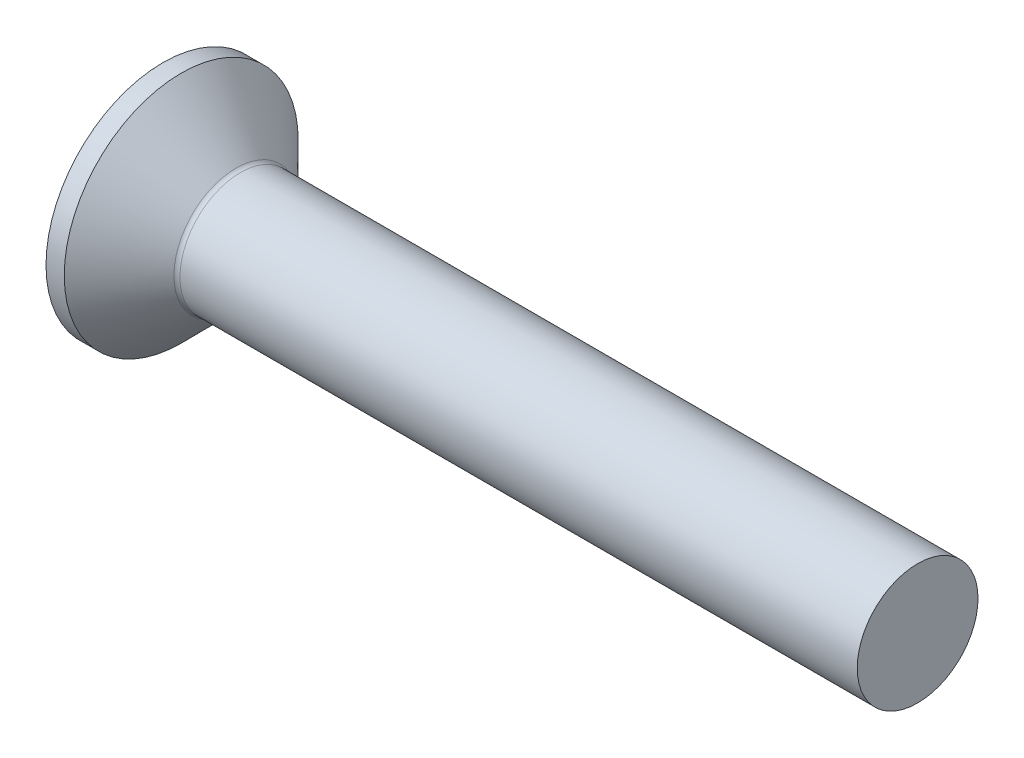
ISO-10303-21;
HEADER;
FILE_DESCRIPTION(('STEP AP214'),'2;1');
FILE_NAME('part.step','',(''),(''),'','','');
FILE_SCHEMA(('AUTOMOTIVE_DESIGN { 1 0 10303 214 1 1 1 1 }'));
ENDSEC;
DATA;
#1=APPLICATION_CONTEXT('core data for automotive mechanical design processes');
#2=APPLICATION_PROTOCOL_DEFINITION('international standard','automotive_design',2000,#1);
#3=PRODUCT_CONTEXT('',#1,'mechanical');
#4=PRODUCT('Part','Part','',(#3));
#5=PRODUCT_RELATED_PRODUCT_CATEGORY('part','',(#4));
#6=PRODUCT_DEFINITION_FORMATION('','',#4);
#7=PRODUCT_DEFINITION_CONTEXT('part definition',#1,'design');
#8=PRODUCT_DEFINITION('design','',#6,#7);
#9=PRODUCT_DEFINITION_SHAPE('','',#8);
#10=(LENGTH_UNIT() NAMED_UNIT(*) SI_UNIT(.MILLI.,.METRE.));
#11=(NAMED_UNIT(*) PLANE_ANGLE_UNIT() SI_UNIT($,.RADIAN.));
#12=(NAMED_UNIT(*) SI_UNIT($,.STERADIAN.) SOLID_ANGLE_UNIT());
#13=UNCERTAINTY_MEASURE_WITH_UNIT(LENGTH_MEASURE(1.E-05),#10,'distance_accuracy_value','');
#14=(GEOMETRIC_REPRESENTATION_CONTEXT(3) GLOBAL_UNCERTAINTY_ASSIGNED_CONTEXT((#13)) GLOBAL_UNIT_ASSIGNED_CONTEXT((#10,
#11,#12)) REPRESENTATION_CONTEXT('',''));
#15=CARTESIAN_POINT('',(0.,0.,0.));
#16=DIRECTION('',(0.,0.,1.));
#17=DIRECTION('',(1.,0.,0.));
#18=AXIS2_PLACEMENT_3D('',#15,#16,#17);
#19=CARTESIAN_POINT('',(0.,0.,0.));
#20=DIRECTION('',(-1.,0.,0.));
#21=DIRECTION('',(0.,0.,1.));
#22=AXIS2_PLACEMENT_3D('',#19,#20,#21);
#23=PLANE('',#22);
#24=CARTESIAN_POINT('',(0.,0.,0.));
#25=DIRECTION('',(-1.,0.,0.));
#26=DIRECTION('',(0.,0.,1.));
#27=AXIS2_PLACEMENT_3D('',#24,#25,#26);
#28=CIRCLE('',#27,7.75);
#29=CARTESIAN_POINT('',(0.,0.,7.75));
#30=VERTEX_POINT('',#29);
#31=EDGE_CURVE('E133',#30,#30,#28,.T.);
#32=ORIENTED_EDGE('',*,*,#31,.T.);
#33=EDGE_LOOP('',(#32));
#34=FACE_BOUND('',#33,.T.);
#35=DIRECTION('',(0.,-0.5,-0.866025403784439));
#36=VECTOR('',#35,1.);
#37=CARTESIAN_POINT('',(0.,-1.44337567297406,2.5));
#38=LINE('',#37,#36);
#39=CARTESIAN_POINT('',(0.,-1.44337567297406,2.5));
#40=VERTEX_POINT('',#39);
#41=CARTESIAN_POINT('',(0.,-2.88675134594813,0.));
#42=VERTEX_POINT('',#41);
#43=EDGE_CURVE('E101',#40,#42,#38,.T.);
#44=ORIENTED_EDGE('',*,*,#43,.T.);
#45=DIRECTION('',(0.,0.5,-0.866025403784439));
#46=VECTOR('',#45,1.);
#47=CARTESIAN_POINT('',(0.,-2.88675134594813,0.));
#48=LINE('',#47,#46);
#49=CARTESIAN_POINT('',(0.,-1.44337567297406,-2.5));
#50=VERTEX_POINT('',#49);
#51=EDGE_CURVE('E31',#42,#50,#48,.T.);
#52=ORIENTED_EDGE('',*,*,#51,.T.);
#53=DIRECTION('',(0.,1.,0.));
#54=VECTOR('',#53,1.);
#55=CARTESIAN_POINT('',(0.,-1.44337567297406,-2.5));
#56=LINE('',#55,#54);
#57=CARTESIAN_POINT('',(0.,1.44337567297406,-2.5));
#58=VERTEX_POINT('',#57);
#59=EDGE_CURVE('E116',#50,#58,#56,.T.);
#60=ORIENTED_EDGE('',*,*,#59,.T.);
#61=DIRECTION('',(0.,0.5,0.866025403784439));
#62=VECTOR('',#61,1.);
#63=CARTESIAN_POINT('',(0.,1.44337567297406,-2.5));
#64=LINE('',#63,#62);
#65=CARTESIAN_POINT('',(0.,2.88675134594813,0.));
#66=VERTEX_POINT('',#65);
#67=EDGE_CURVE('E248',#58,#66,#64,.T.);
#68=ORIENTED_EDGE('',*,*,#67,.T.);
#69=DIRECTION('',(0.,-0.5,0.866025403784439));
#70=VECTOR('',#69,1.);
#71=CARTESIAN_POINT('',(0.,2.88675134594813,0.));
#72=LINE('',#71,#70);
#73=CARTESIAN_POINT('',(0.,1.44337567297406,2.5));
#74=VERTEX_POINT('',#73);
#75=EDGE_CURVE('E251',#66,#74,#72,.T.);
#76=ORIENTED_EDGE('',*,*,#75,.T.);
#77=DIRECTION('',(0.,-1.,0.));
#78=VECTOR('',#77,1.);
#79=CARTESIAN_POINT('',(0.,1.44337567297406,2.5));
#80=LINE('',#79,#78);
#81=EDGE_CURVE('E254',#74,#40,#80,.T.);
#82=ORIENTED_EDGE('',*,*,#81,.T.);
#83=EDGE_LOOP('',(#44,#52,#60,#68,#76,#82));
#84=FACE_BOUND('',#83,.T.);
#85=ADVANCED_FACE('F16',(#34,#84),#23,.T.);
#86=CARTESIAN_POINT('',(0.,0.,0.));
#87=DIRECTION('',(-1.,0.,0.));
#88=DIRECTION('',(0.,0.,1.));
#89=AXIS2_PLACEMENT_3D('',#86,#87,#88);
#90=CYLINDRICAL_SURFACE('',#89,7.75);
#91=CARTESIAN_POINT('',(1.21000000000001,0.,0.));
#92=DIRECTION('',(-1.,0.,0.));
#93=DIRECTION('',(0.,0.,1.));
#94=AXIS2_PLACEMENT_3D('',#91,#92,#93);
#95=CIRCLE('',#94,7.75);
#96=CARTESIAN_POINT('',(1.21000000000001,0.,7.75));
#97=VERTEX_POINT('',#96);
#98=EDGE_CURVE('E129',#97,#97,#95,.T.);
#99=ORIENTED_EDGE('',*,*,#98,.T.);
#100=EDGE_LOOP('',(#99));
#101=FACE_BOUND('',#100,.T.);
#102=ORIENTED_EDGE('',*,*,#31,.F.);
#103=EDGE_LOOP('',(#102));
#104=FACE_BOUND('',#103,.T.);
#105=ADVANCED_FACE('F155',(#101,#104),#90,.T.);
#106=CARTESIAN_POINT('',(1.21000000000001,0.,0.));
#107=DIRECTION('',(-1.,0.,0.));
#108=DIRECTION('',(0.,0.,1.));
#109=AXIS2_PLACEMENT_3D('',#106,#107,#108);
#110=CONICAL_SURFACE('',#109,7.75,0.78539816339745);
#111=CARTESIAN_POINT('',(4.84284271247463,0.,0.));
#112=DIRECTION('',(-1.,0.,0.));
#113=DIRECTION('',(0.,0.,1.));
#114=AXIS2_PLACEMENT_3D('',#111,#112,#113);
#115=CIRCLE('',#114,4.11715728752537);
#116=CARTESIAN_POINT('',(4.84284271247463,0.,4.11715728752537));
#117=VERTEX_POINT('',#116);
#118=EDGE_CURVE('E24',#117,#117,#115,.T.);
#119=ORIENTED_EDGE('',*,*,#118,.T.);
#120=EDGE_LOOP('',(#119));
#121=FACE_BOUND('',#120,.T.);
#122=ORIENTED_EDGE('',*,*,#98,.F.);
#123=EDGE_LOOP('',(#122));
#124=FACE_BOUND('',#123,.T.);
#125=ADVANCED_FACE('F138',(#121,#124),#110,.T.);
#126=CARTESIAN_POINT('',(0.,0.,0.));
#127=DIRECTION('',(-1.,0.,0.));
#128=DIRECTION('',(0.,0.,1.));
#129=AXIS2_PLACEMENT_3D('',#126,#127,#128);
#130=CYLINDRICAL_SURFACE('',#129,4.);
#131=CARTESIAN_POINT('',(5.12568542494925,0.,0.));
#132=DIRECTION('',(-1.,0.,0.));
#133=DIRECTION('',(0.,0.,1.));
#134=AXIS2_PLACEMENT_3D('',#131,#132,#133);
#135=CIRCLE('',#134,4.);
#136=CARTESIAN_POINT('',(5.12568542494925,0.,4.));
#137=VERTEX_POINT('',#136);
#138=EDGE_CURVE('E11',#137,#137,#135,.F.);
#139=ORIENTED_EDGE('',*,*,#138,.T.);
#140=EDGE_LOOP('',(#139));
#141=FACE_BOUND('',#140,.T.);
#142=CARTESIAN_POINT('',(50.,0.,0.));
#143=DIRECTION('',(1.,0.,0.));
#144=DIRECTION('',(0.,0.,-1.));
#145=AXIS2_PLACEMENT_3D('',#142,#143,#144);
#146=CIRCLE('',#145,4.);
#147=CARTESIAN_POINT('',(50.,0.,-4.));
#148=VERTEX_POINT('',#147);
#149=EDGE_CURVE('E246',#148,#148,#146,.T.);
#150=ORIENTED_EDGE('',*,*,#149,.F.);
#151=EDGE_LOOP('',(#150));
#152=FACE_BOUND('',#151,.T.);
#153=ADVANCED_FACE('F142',(#141,#152),#130,.T.);
#154=CARTESIAN_POINT('',(5.12568542494925,0.,0.));
#155=DIRECTION('',(-1.,0.,0.));
#156=DIRECTION('',(0.,0.,1.));
#157=AXIS2_PLACEMENT_3D('',#154,#155,#156);
#158=TOROIDAL_SURFACE('',#157,4.4,0.4);
#159=ORIENTED_EDGE('',*,*,#138,.F.);
#160=EDGE_LOOP('',(#159));
#161=FACE_BOUND('',#160,.T.);
#162=ORIENTED_EDGE('',*,*,#118,.F.);
#163=EDGE_LOOP('',(#162));
#164=FACE_BOUND('',#163,.T.);
#165=ADVANCED_FACE('F18',(#161,#164),#158,.F.);
#166=CARTESIAN_POINT('',(3.,-2.88675134594813,0.));
#167=DIRECTION('',(0.,0.866025403784439,0.5));
#168=DIRECTION('',(0.,-0.5,0.866025403784439));
#169=AXIS2_PLACEMENT_3D('',#166,#167,#168);
#170=PLANE('',#169);
#171=ORIENTED_EDGE('',*,*,#51,.F.);
#172=DIRECTION('',(-1.,0.,0.));
#173=VECTOR('',#172,1.);
#174=CARTESIAN_POINT('',(3.,-2.88675134594813,0.));
#175=LINE('',#174,#173);
#176=CARTESIAN_POINT('',(3.,-2.88675134594813,0.));
#177=VERTEX_POINT('',#176);
#178=EDGE_CURVE('E244',#177,#42,#175,.T.);
#179=ORIENTED_EDGE('',*,*,#178,.F.);
#180=DIRECTION('',(0.,0.5,-0.866025403784439));
#181=VECTOR('',#180,1.);
#182=CARTESIAN_POINT('',(3.,-2.88675134594813,0.));
#183=LINE('',#182,#181);
#184=CARTESIAN_POINT('',(3.,-2.1650635094611,-1.25));
#185=VERTEX_POINT('',#184);
#186=EDGE_CURVE('E98',#177,#185,#183,.T.);
#187=ORIENTED_EDGE('',*,*,#186,.T.);
#188=CARTESIAN_POINT('',(3.,-1.44337567297406,-2.5));
#189=VERTEX_POINT('',#188);
#190=EDGE_CURVE('E92',#185,#189,#183,.T.);
#191=ORIENTED_EDGE('',*,*,#190,.T.);
#192=DIRECTION('',(-1.,0.,0.));
#193=VECTOR('',#192,1.);
#194=CARTESIAN_POINT('',(3.,-1.44337567297406,-2.5));
#195=LINE('',#194,#193);
#196=EDGE_CURVE('E96',#189,#50,#195,.T.);
#197=ORIENTED_EDGE('',*,*,#196,.T.);
#198=EDGE_LOOP('',(#171,#179,#187,#191,#197));
#199=FACE_BOUND('',#198,.T.);
#200=ADVANCED_FACE('F94',(#199),#170,.T.);
#201=CARTESIAN_POINT('',(3.,-1.44337567297406,-2.5));
#202=DIRECTION('',(0.,0.,1.));
#203=DIRECTION('',(1.,0.,0.));
#204=AXIS2_PLACEMENT_3D('',#201,#202,#203);
#205=PLANE('',#204);
#206=ORIENTED_EDGE('',*,*,#59,.F.);
#207=ORIENTED_EDGE('',*,*,#196,.F.);
#208=DIRECTION('',(0.,1.,0.));
#209=VECTOR('',#208,1.);
#210=CARTESIAN_POINT('',(3.,-1.44337567297406,-2.5));
#211=LINE('',#210,#209);
#212=CARTESIAN_POINT('',(3.,0.,-2.5));
#213=VERTEX_POINT('',#212);
#214=EDGE_CURVE('E104',#189,#213,#211,.T.);
#215=ORIENTED_EDGE('',*,*,#214,.T.);
#216=CARTESIAN_POINT('',(3.,1.44337567297406,-2.5));
#217=VERTEX_POINT('',#216);
#218=EDGE_CURVE('E111',#213,#217,#211,.T.);
#219=ORIENTED_EDGE('',*,*,#218,.T.);
#220=DIRECTION('',(-1.,0.,0.));
#221=VECTOR('',#220,1.);
#222=CARTESIAN_POINT('',(3.,1.44337567297406,-2.5));
#223=LINE('',#222,#221);
#224=EDGE_CURVE('E118',#217,#58,#223,.T.);
#225=ORIENTED_EDGE('',*,*,#224,.T.);
#226=EDGE_LOOP('',(#206,#207,#215,#219,#225));
#227=FACE_BOUND('',#226,.T.);
#228=ADVANCED_FACE('F113',(#227),#205,.T.);
#229=CARTESIAN_POINT('',(3.,1.44337567297406,-2.5));
#230=DIRECTION('',(0.,-0.866025403784438,0.5));
#231=DIRECTION('',(0.,-0.5,-0.866025403784439));
#232=AXIS2_PLACEMENT_3D('',#229,#230,#231);
#233=PLANE('',#232);
#234=ORIENTED_EDGE('',*,*,#67,.F.);
#235=ORIENTED_EDGE('',*,*,#224,.F.);
#236=DIRECTION('',(0.,0.5,0.866025403784439));
#237=VECTOR('',#236,1.);
#238=CARTESIAN_POINT('',(3.,1.44337567297406,-2.5));
#239=LINE('',#238,#237);
#240=CARTESIAN_POINT('',(3.,2.1650635094611,-1.25));
#241=VERTEX_POINT('',#240);
#242=EDGE_CURVE('E236',#217,#241,#239,.T.);
#243=ORIENTED_EDGE('',*,*,#242,.T.);
#244=CARTESIAN_POINT('',(3.,2.88675134594813,0.));
#245=VERTEX_POINT('',#244);
#246=EDGE_CURVE('E110',#241,#245,#239,.T.);
#247=ORIENTED_EDGE('',*,*,#246,.T.);
#248=DIRECTION('',(-1.,0.,0.));
#249=VECTOR('',#248,1.);
#250=CARTESIAN_POINT('',(3.,2.88675134594813,0.));
#251=LINE('',#250,#249);
#252=EDGE_CURVE('E124',#245,#66,#251,.T.);
#253=ORIENTED_EDGE('',*,*,#252,.T.);
#254=EDGE_LOOP('',(#234,#235,#243,#247,#253));
#255=FACE_BOUND('',#254,.T.);
#256=ADVANCED_FACE('F178',(#255),#233,.T.);
#257=CARTESIAN_POINT('',(3.,2.88675134594813,0.));
#258=DIRECTION('',(0.,-0.866025403784439,-0.5));
#259=DIRECTION('',(0.,0.5,-0.866025403784439));
#260=AXIS2_PLACEMENT_3D('',#257,#258,#259);
#261=PLANE('',#260);
#262=ORIENTED_EDGE('',*,*,#75,.F.);
#263=ORIENTED_EDGE('',*,*,#252,.F.);
#264=DIRECTION('',(0.,-0.5,0.866025403784439));
#265=VECTOR('',#264,1.);
#266=CARTESIAN_POINT('',(3.,2.88675134594813,0.));
#267=LINE('',#266,#265);
#268=CARTESIAN_POINT('',(3.,2.1650635094611,1.25));
#269=VERTEX_POINT('',#268);
#270=EDGE_CURVE('E39',#245,#269,#267,.T.);
#271=ORIENTED_EDGE('',*,*,#270,.T.);
#272=CARTESIAN_POINT('',(3.,1.44337567297406,2.5));
#273=VERTEX_POINT('',#272);
#274=EDGE_CURVE('E215',#269,#273,#267,.T.);
#275=ORIENTED_EDGE('',*,*,#274,.T.);
#276=DIRECTION('',(-1.,0.,0.));
#277=VECTOR('',#276,1.);
#278=CARTESIAN_POINT('',(3.,1.44337567297406,2.5));
#279=LINE('',#278,#277);
#280=EDGE_CURVE('E229',#273,#74,#279,.T.);
#281=ORIENTED_EDGE('',*,*,#280,.T.);
#282=EDGE_LOOP('',(#262,#263,#271,#275,#281));
#283=FACE_BOUND('',#282,.T.);
#284=ADVANCED_FACE('F181',(#283),#261,.T.);
#285=CARTESIAN_POINT('',(3.,1.44337567297406,2.5));
#286=DIRECTION('',(0.,0.,-1.));
#287=DIRECTION('',(-1.,0.,0.));
#288=AXIS2_PLACEMENT_3D('',#285,#286,#287);
#289=PLANE('',#288);
#290=ORIENTED_EDGE('',*,*,#81,.F.);
#291=ORIENTED_EDGE('',*,*,#280,.F.);
#292=DIRECTION('',(0.,-1.,0.));
#293=VECTOR('',#292,1.);
#294=CARTESIAN_POINT('',(3.,1.44337567297406,2.5));
#295=LINE('',#294,#293);
#296=CARTESIAN_POINT('',(3.,0.,2.5));
#297=VERTEX_POINT('',#296);
#298=EDGE_CURVE('E214',#273,#297,#295,.T.);
#299=ORIENTED_EDGE('',*,*,#298,.T.);
#300=CARTESIAN_POINT('',(3.,-1.44337567297406,2.5));
#301=VERTEX_POINT('',#300);
#302=EDGE_CURVE('E220',#297,#301,#295,.T.);
#303=ORIENTED_EDGE('',*,*,#302,.T.);
#304=DIRECTION('',(-1.,0.,0.));
#305=VECTOR('',#304,1.);
#306=CARTESIAN_POINT('',(3.,-1.44337567297406,2.5));
#307=LINE('',#306,#305);
#308=EDGE_CURVE('E260',#301,#40,#307,.T.);
#309=ORIENTED_EDGE('',*,*,#308,.T.);
#310=EDGE_LOOP('',(#290,#291,#299,#303,#309));
#311=FACE_BOUND('',#310,.T.);
#312=ADVANCED_FACE('F185',(#311),#289,.T.);
#313=CARTESIAN_POINT('',(3.,-1.44337567297406,2.5));
#314=DIRECTION('',(0.,0.866025403784439,-0.5));
#315=DIRECTION('',(0.,0.5,0.866025403784439));
#316=AXIS2_PLACEMENT_3D('',#313,#314,#315);
#317=PLANE('',#316);
#318=ORIENTED_EDGE('',*,*,#43,.F.);
#319=ORIENTED_EDGE('',*,*,#308,.F.);
#320=DIRECTION('',(0.,-0.5,-0.866025403784439));
#321=VECTOR('',#320,1.);
#322=CARTESIAN_POINT('',(3.,-1.44337567297406,2.5));
#323=LINE('',#322,#321);
#324=CARTESIAN_POINT('',(3.,-2.1650635094611,1.25));
#325=VERTEX_POINT('',#324);
#326=EDGE_CURVE('E223',#301,#325,#323,.T.);
#327=ORIENTED_EDGE('',*,*,#326,.T.);
#328=EDGE_CURVE('E230',#325,#177,#323,.T.);
#329=ORIENTED_EDGE('',*,*,#328,.T.);
#330=ORIENTED_EDGE('',*,*,#178,.T.);
#331=EDGE_LOOP('',(#318,#319,#327,#329,#330));
#332=FACE_BOUND('',#331,.T.);
#333=ADVANCED_FACE('F188',(#332),#317,.T.);
#334=CARTESIAN_POINT('',(3.,-2.88675134594813,0.));
#335=DIRECTION('',(-1.,0.,0.));
#336=DIRECTION('',(0.,0.,1.));
#337=AXIS2_PLACEMENT_3D('',#334,#335,#336);
#338=PLANE('',#337);
#339=CARTESIAN_POINT('',(3.,0.,0.));
#340=DIRECTION('',(-1.,0.,0.));
#341=DIRECTION('',(0.,0.,1.));
#342=AXIS2_PLACEMENT_3D('',#339,#340,#341);
#343=CIRCLE('',#342,2.5);
#344=EDGE_CURVE('E117',#325,#297,#343,.T.);
#345=ORIENTED_EDGE('',*,*,#344,.F.);
#346=ORIENTED_EDGE('',*,*,#326,.F.);
#347=ORIENTED_EDGE('',*,*,#302,.F.);
#348=EDGE_LOOP('',(#345,#346,#347));
#349=FACE_BOUND('',#348,.T.);
#350=ADVANCED_FACE('F192',(#349),#338,.T.);
#351=EDGE_CURVE('E121',#185,#325,#343,.T.);
#352=ORIENTED_EDGE('',*,*,#351,.F.);
#353=ORIENTED_EDGE('',*,*,#186,.F.);
#354=ORIENTED_EDGE('',*,*,#328,.F.);
#355=EDGE_LOOP('',(#352,#353,#354));
#356=FACE_BOUND('',#355,.T.);
#357=ADVANCED_FACE('F195',(#356),#338,.T.);
#358=EDGE_CURVE('E106',#213,#185,#343,.T.);
#359=ORIENTED_EDGE('',*,*,#358,.F.);
#360=ORIENTED_EDGE('',*,*,#214,.F.);
#361=ORIENTED_EDGE('',*,*,#190,.F.);
#362=EDGE_LOOP('',(#359,#360,#361));
#363=FACE_BOUND('',#362,.T.);
#364=ADVANCED_FACE('F105',(#363),#338,.T.);
#365=EDGE_CURVE('E232',#241,#213,#343,.T.);
#366=ORIENTED_EDGE('',*,*,#365,.F.);
#367=ORIENTED_EDGE('',*,*,#242,.F.);
#368=ORIENTED_EDGE('',*,*,#218,.F.);
#369=EDGE_LOOP('',(#366,#367,#368));
#370=FACE_BOUND('',#369,.T.);
#371=ADVANCED_FACE('F209',(#370),#338,.T.);
#372=EDGE_CURVE('E130',#269,#241,#343,.T.);
#373=ORIENTED_EDGE('',*,*,#372,.F.);
#374=ORIENTED_EDGE('',*,*,#270,.F.);
#375=ORIENTED_EDGE('',*,*,#246,.F.);
#376=EDGE_LOOP('',(#373,#374,#375));
#377=FACE_BOUND('',#376,.T.);
#378=ADVANCED_FACE('F203',(#377),#338,.T.);
#379=EDGE_CURVE('E123',#297,#269,#343,.T.);
#380=ORIENTED_EDGE('',*,*,#379,.F.);
#381=ORIENTED_EDGE('',*,*,#298,.F.);
#382=ORIENTED_EDGE('',*,*,#274,.F.);
#383=EDGE_LOOP('',(#380,#381,#382));
#384=FACE_BOUND('',#383,.T.);
#385=ADVANCED_FACE('F173',(#384),#338,.T.);
#386=CARTESIAN_POINT('',(3.,0.,0.));
#387=DIRECTION('',(-1.,0.,0.));
#388=DIRECTION('',(0.,0.,1.));
#389=AXIS2_PLACEMENT_3D('',#386,#387,#388);
#390=CONICAL_SURFACE('',#389,2.5,1.0471975511966);
#391=CARTESIAN_POINT('',(4.44337567297408,0.,0.));
#392=VERTEX_POINT('',#391);
#393=VERTEX_LOOP('',#392);
#394=FACE_BOUND('',#393,.T.);
#395=ORIENTED_EDGE('',*,*,#379,.T.);
#396=ORIENTED_EDGE('',*,*,#372,.T.);
#397=ORIENTED_EDGE('',*,*,#365,.T.);
#398=ORIENTED_EDGE('',*,*,#358,.T.);
#399=ORIENTED_EDGE('',*,*,#351,.T.);
#400=ORIENTED_EDGE('',*,*,#344,.T.);
#401=EDGE_LOOP('',(#395,#396,#397,#398,#399,#400));
#402=FACE_BOUND('',#401,.T.);
#403=ADVANCED_FACE('F170',(#394,#402),#390,.F.);
#404=CARTESIAN_POINT('',(50.,3.3095,0.));
#405=DIRECTION('',(1.,0.,0.));
#406=DIRECTION('',(0.,0.,-1.));
#407=AXIS2_PLACEMENT_3D('',#404,#405,#406);
#408=PLANE('',#407);
#409=ORIENTED_EDGE('',*,*,#149,.T.);
#410=EDGE_LOOP('',(#409));
#411=FACE_BOUND('',#410,.T.);
#412=ADVANCED_FACE('F167',(#411),#408,.T.);
#413=CLOSED_SHELL('',(#85,#105,#125,#153,#165,#200,#228,#256,#284,#312,#333,#350,#357,#364,#371,
#378,#385,#403,#412));
#414=MANIFOLD_SOLID_BREP('B1',#413);
#415=ADVANCED_BREP_SHAPE_REPRESENTATION('',(#18,#414),#14);
#416=SHAPE_DEFINITION_REPRESENTATION(#9,#415);
ENDSEC;
END-ISO-10303-21;
